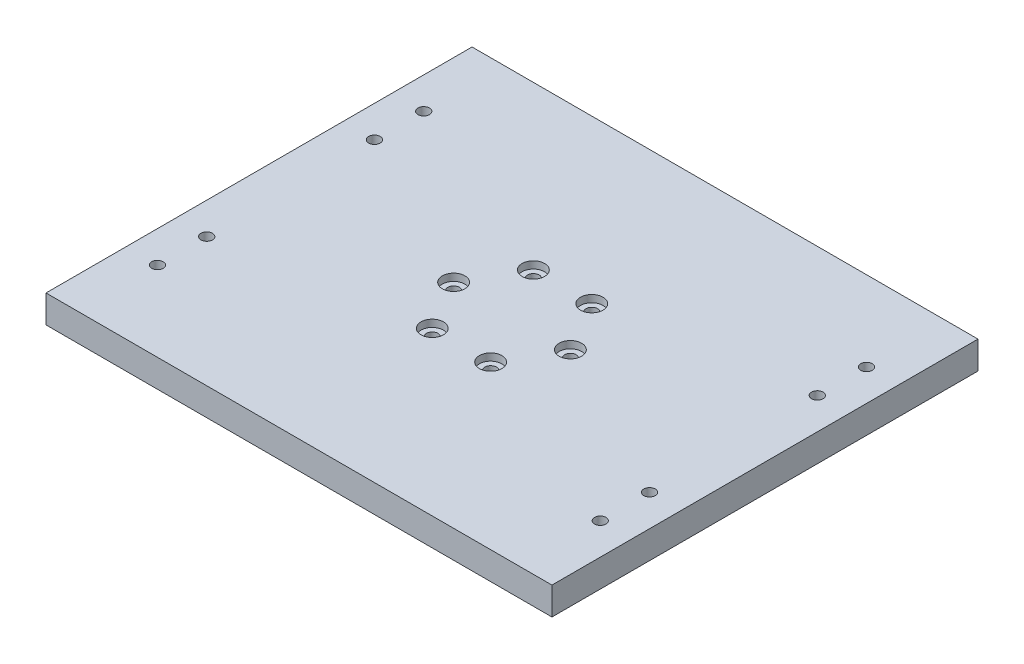
ISO-10303-21;
HEADER;
FILE_DESCRIPTION(('STEP AP214'),'2;1');
FILE_NAME('part.step','',(''),(''),'','','');
FILE_SCHEMA(('AUTOMOTIVE_DESIGN { 1 0 10303 214 1 1 1 1 }'));
ENDSEC;
DATA;
#1=APPLICATION_CONTEXT('core data for automotive mechanical design processes');
#2=APPLICATION_PROTOCOL_DEFINITION('international standard','automotive_design',2000,#1);
#3=PRODUCT_CONTEXT('',#1,'mechanical');
#4=PRODUCT('Part','Part','',(#3));
#5=PRODUCT_RELATED_PRODUCT_CATEGORY('part','',(#4));
#6=PRODUCT_DEFINITION_FORMATION('','',#4);
#7=PRODUCT_DEFINITION_CONTEXT('part definition',#1,'design');
#8=PRODUCT_DEFINITION('design','',#6,#7);
#9=PRODUCT_DEFINITION_SHAPE('','',#8);
#10=(LENGTH_UNIT() NAMED_UNIT(*) SI_UNIT(.MILLI.,.METRE.));
#11=(NAMED_UNIT(*) PLANE_ANGLE_UNIT() SI_UNIT($,.RADIAN.));
#12=(NAMED_UNIT(*) SI_UNIT($,.STERADIAN.) SOLID_ANGLE_UNIT());
#13=UNCERTAINTY_MEASURE_WITH_UNIT(LENGTH_MEASURE(1.E-05),#10,'distance_accuracy_value','');
#14=(GEOMETRIC_REPRESENTATION_CONTEXT(3) GLOBAL_UNCERTAINTY_ASSIGNED_CONTEXT((#13)) GLOBAL_UNIT_ASSIGNED_CONTEXT((#10,
#11,#12)) REPRESENTATION_CONTEXT('',''));
#15=CARTESIAN_POINT('',(0.,0.,0.));
#16=DIRECTION('',(0.,0.,1.));
#17=DIRECTION('',(1.,0.,0.));
#18=AXIS2_PLACEMENT_3D('',#15,#16,#17);
#19=CARTESIAN_POINT('',(0.,26.416,0.));
#20=DIRECTION('',(0.,-1.,0.));
#21=DIRECTION('',(0.,0.,-1.));
#22=AXIS2_PLACEMENT_3D('',#19,#20,#21);
#23=PLANE('',#22);
#24=CARTESIAN_POINT('',(-211.201,26.416,-127.));
#25=DIRECTION('',(0.,1.,0.));
#26=DIRECTION('',(0.,0.,1.));
#27=AXIS2_PLACEMENT_3D('',#24,#25,#26);
#28=CIRCLE('',#27,5.50000000000001);
#29=CARTESIAN_POINT('',(-211.201,26.416,-121.5));
#30=VERTEX_POINT('',#29);
#31=EDGE_CURVE('E297',#30,#30,#28,.T.);
#32=ORIENTED_EDGE('',*,*,#31,.F.);
#33=EDGE_LOOP('',(#32));
#34=FACE_BOUND('',#33,.T.);
#35=CARTESIAN_POINT('',(-211.201,26.416,-80.01));
#36=DIRECTION('',(0.,1.,0.));
#37=DIRECTION('',(0.,0.,1.));
#38=AXIS2_PLACEMENT_3D('',#35,#36,#37);
#39=CIRCLE('',#38,5.50000000000001);
#40=CARTESIAN_POINT('',(-211.201,26.416,-74.51));
#41=VERTEX_POINT('',#40);
#42=EDGE_CURVE('E289',#41,#41,#39,.T.);
#43=ORIENTED_EDGE('',*,*,#42,.F.);
#44=EDGE_LOOP('',(#43));
#45=FACE_BOUND('',#44,.T.);
#46=CARTESIAN_POINT('',(-211.201,26.416,80.01));
#47=DIRECTION('',(0.,1.,0.));
#48=DIRECTION('',(0.,0.,1.));
#49=AXIS2_PLACEMENT_3D('',#46,#47,#48);
#50=CIRCLE('',#49,5.50000000000001);
#51=CARTESIAN_POINT('',(-211.201,26.416,85.51));
#52=VERTEX_POINT('',#51);
#53=EDGE_CURVE('E281',#52,#52,#50,.T.);
#54=ORIENTED_EDGE('',*,*,#53,.F.);
#55=EDGE_LOOP('',(#54));
#56=FACE_BOUND('',#55,.T.);
#57=DIRECTION('',(0.,0.,-1.));
#58=VECTOR('',#57,1.);
#59=CARTESIAN_POINT('',(241.3,26.416,203.2));
#60=LINE('',#59,#58);
#61=CARTESIAN_POINT('',(241.3,26.416,203.2));
#62=VERTEX_POINT('',#61);
#63=CARTESIAN_POINT('',(241.3,26.416,-203.2));
#64=VERTEX_POINT('',#63);
#65=EDGE_CURVE('E98',#62,#64,#60,.T.);
#66=ORIENTED_EDGE('',*,*,#65,.T.);
#67=DIRECTION('',(-1.,0.,0.));
#68=VECTOR('',#67,1.);
#69=CARTESIAN_POINT('',(-241.3,26.416,-203.2));
#70=LINE('',#69,#68);
#71=CARTESIAN_POINT('',(-241.3,26.416,-203.2));
#72=VERTEX_POINT('',#71);
#73=EDGE_CURVE('E93',#64,#72,#70,.T.);
#74=ORIENTED_EDGE('',*,*,#73,.T.);
#75=DIRECTION('',(0.,0.,1.));
#76=VECTOR('',#75,1.);
#77=CARTESIAN_POINT('',(-241.3,26.416,203.2));
#78=LINE('',#77,#76);
#79=CARTESIAN_POINT('',(-241.3,26.416,203.2));
#80=VERTEX_POINT('',#79);
#81=EDGE_CURVE('E96',#72,#80,#78,.T.);
#82=ORIENTED_EDGE('',*,*,#81,.T.);
#83=DIRECTION('',(1.,0.,0.));
#84=VECTOR('',#83,1.);
#85=CARTESIAN_POINT('',(-241.3,26.416,203.2));
#86=LINE('',#85,#84);
#87=EDGE_CURVE('E63',#80,#62,#86,.T.);
#88=ORIENTED_EDGE('',*,*,#87,.T.);
#89=EDGE_LOOP('',(#66,#74,#82,#88));
#90=FACE_BOUND('',#89,.T.);
#91=CARTESIAN_POINT('',(-27.8500000000002,26.416,-48.2376149907929));
#92=DIRECTION('',(0.,1.,0.));
#93=DIRECTION('',(0.,0.,1.));
#94=AXIS2_PLACEMENT_3D('',#91,#92,#93);
#95=CIRCLE('',#94,10.74);
#96=CARTESIAN_POINT('',(-27.8500000000002,26.416,-37.4976149907929));
#97=VERTEX_POINT('',#96);
#98=EDGE_CURVE('E153',#97,#97,#95,.T.);
#99=ORIENTED_EDGE('',*,*,#98,.F.);
#100=EDGE_LOOP('',(#99));
#101=FACE_BOUND('',#100,.T.);
#102=CARTESIAN_POINT('',(-55.7,26.416,-3.88951021147125E-13));
#103=DIRECTION('',(0.,1.,0.));
#104=DIRECTION('',(0.,0.,1.));
#105=AXIS2_PLACEMENT_3D('',#102,#103,#104);
#106=CIRCLE('',#105,10.74);
#107=CARTESIAN_POINT('',(-55.7,26.416,10.7399999999996));
#108=VERTEX_POINT('',#107);
#109=EDGE_CURVE('E169',#108,#108,#106,.T.);
#110=ORIENTED_EDGE('',*,*,#109,.F.);
#111=EDGE_LOOP('',(#110));
#112=FACE_BOUND('',#111,.T.);
#113=CARTESIAN_POINT('',(-27.8500000000002,26.416,48.2376149907931));
#114=DIRECTION('',(0.,1.,0.));
#115=DIRECTION('',(0.,0.,1.));
#116=AXIS2_PLACEMENT_3D('',#113,#114,#115);
#117=CIRCLE('',#116,10.74);
#118=CARTESIAN_POINT('',(-27.8500000000002,26.416,58.9776149907931));
#119=VERTEX_POINT('',#118);
#120=EDGE_CURVE('E185',#119,#119,#117,.T.);
#121=ORIENTED_EDGE('',*,*,#120,.F.);
#122=EDGE_LOOP('',(#121));
#123=FACE_BOUND('',#122,.T.);
#124=CARTESIAN_POINT('',(27.8499999999999,26.416,48.2376149907933));
#125=DIRECTION('',(0.,1.,0.));
#126=DIRECTION('',(0.,0.,1.));
#127=AXIS2_PLACEMENT_3D('',#124,#125,#126);
#128=CIRCLE('',#127,10.74);
#129=CARTESIAN_POINT('',(27.8499999999999,26.416,58.9776149907933));
#130=VERTEX_POINT('',#129);
#131=EDGE_CURVE('E201',#130,#130,#128,.T.);
#132=ORIENTED_EDGE('',*,*,#131,.F.);
#133=EDGE_LOOP('',(#132));
#134=FACE_BOUND('',#133,.T.);
#135=CARTESIAN_POINT('',(55.7,26.416,0.));
#136=DIRECTION('',(0.,1.,0.));
#137=DIRECTION('',(0.,0.,1.));
#138=AXIS2_PLACEMENT_3D('',#135,#136,#137);
#139=CIRCLE('',#138,10.74);
#140=CARTESIAN_POINT('',(55.7,26.416,10.74));
#141=VERTEX_POINT('',#140);
#142=EDGE_CURVE('E217',#141,#141,#139,.T.);
#143=ORIENTED_EDGE('',*,*,#142,.F.);
#144=EDGE_LOOP('',(#143));
#145=FACE_BOUND('',#144,.T.);
#146=CARTESIAN_POINT('',(27.8500000000006,26.416,-48.2376149907929));
#147=DIRECTION('',(0.,1.,0.));
#148=DIRECTION('',(0.,0.,1.));
#149=AXIS2_PLACEMENT_3D('',#146,#147,#148);
#150=CIRCLE('',#149,10.74);
#151=CARTESIAN_POINT('',(27.8500000000006,26.416,-37.4976149907929));
#152=VERTEX_POINT('',#151);
#153=EDGE_CURVE('E233',#152,#152,#150,.T.);
#154=ORIENTED_EDGE('',*,*,#153,.F.);
#155=EDGE_LOOP('',(#154));
#156=FACE_BOUND('',#155,.T.);
#157=CARTESIAN_POINT('',(211.201,26.416,-127.));
#158=DIRECTION('',(0.,1.,0.));
#159=DIRECTION('',(0.,0.,1.));
#160=AXIS2_PLACEMENT_3D('',#157,#158,#159);
#161=CIRCLE('',#160,5.50000000000001);
#162=CARTESIAN_POINT('',(211.201,26.416,-121.5));
#163=VERTEX_POINT('',#162);
#164=EDGE_CURVE('E241',#163,#163,#161,.T.);
#165=ORIENTED_EDGE('',*,*,#164,.F.);
#166=EDGE_LOOP('',(#165));
#167=FACE_BOUND('',#166,.T.);
#168=CARTESIAN_POINT('',(211.201,26.416,-80.01));
#169=DIRECTION('',(0.,1.,0.));
#170=DIRECTION('',(0.,0.,1.));
#171=AXIS2_PLACEMENT_3D('',#168,#169,#170);
#172=CIRCLE('',#171,5.50000000000001);
#173=CARTESIAN_POINT('',(211.201,26.416,-74.51));
#174=VERTEX_POINT('',#173);
#175=EDGE_CURVE('E249',#174,#174,#172,.T.);
#176=ORIENTED_EDGE('',*,*,#175,.F.);
#177=EDGE_LOOP('',(#176));
#178=FACE_BOUND('',#177,.T.);
#179=CARTESIAN_POINT('',(211.201,26.416,80.0099999999999));
#180=DIRECTION('',(0.,1.,0.));
#181=DIRECTION('',(0.,0.,1.));
#182=AXIS2_PLACEMENT_3D('',#179,#180,#181);
#183=CIRCLE('',#182,5.50000000000001);
#184=CARTESIAN_POINT('',(211.201,26.416,85.5099999999999));
#185=VERTEX_POINT('',#184);
#186=EDGE_CURVE('E257',#185,#185,#183,.T.);
#187=ORIENTED_EDGE('',*,*,#186,.F.);
#188=EDGE_LOOP('',(#187));
#189=FACE_BOUND('',#188,.T.);
#190=CARTESIAN_POINT('',(211.201,26.416,127.));
#191=DIRECTION('',(0.,1.,0.));
#192=DIRECTION('',(0.,0.,1.));
#193=AXIS2_PLACEMENT_3D('',#190,#191,#192);
#194=CIRCLE('',#193,5.50000000000001);
#195=CARTESIAN_POINT('',(211.201,26.416,132.5));
#196=VERTEX_POINT('',#195);
#197=EDGE_CURVE('E265',#196,#196,#194,.T.);
#198=ORIENTED_EDGE('',*,*,#197,.F.);
#199=EDGE_LOOP('',(#198));
#200=FACE_BOUND('',#199,.T.);
#201=CARTESIAN_POINT('',(-211.201,26.416,127.));
#202=DIRECTION('',(0.,1.,0.));
#203=DIRECTION('',(0.,0.,1.));
#204=AXIS2_PLACEMENT_3D('',#201,#202,#203);
#205=CIRCLE('',#204,5.50000000000001);
#206=CARTESIAN_POINT('',(-211.201,26.416,132.5));
#207=VERTEX_POINT('',#206);
#208=EDGE_CURVE('E273',#207,#207,#205,.T.);
#209=ORIENTED_EDGE('',*,*,#208,.F.);
#210=EDGE_LOOP('',(#209));
#211=FACE_BOUND('',#210,.T.);
#212=ADVANCED_FACE('F45',(#34,#45,#56,#90,#101,#112,#123,#134,#145,#156,#167,#178,#189,#200,
#211),#23,.F.);
#213=CARTESIAN_POINT('',(0.,0.,0.));
#214=DIRECTION('',(0.,-1.,0.));
#215=DIRECTION('',(0.,0.,-1.));
#216=AXIS2_PLACEMENT_3D('',#213,#214,#215);
#217=PLANE('',#216);
#218=CARTESIAN_POINT('',(-211.201,0.,-127.));
#219=DIRECTION('',(0.,1.,0.));
#220=DIRECTION('',(0.,0.,1.));
#221=AXIS2_PLACEMENT_3D('',#218,#219,#220);
#222=CIRCLE('',#221,5.50000000000001);
#223=CARTESIAN_POINT('',(-211.201,0.,-121.5));
#224=VERTEX_POINT('',#223);
#225=EDGE_CURVE('E293',#224,#224,#222,.T.);
#226=ORIENTED_EDGE('',*,*,#225,.T.);
#227=EDGE_LOOP('',(#226));
#228=FACE_BOUND('',#227,.T.);
#229=CARTESIAN_POINT('',(-211.201,0.,-80.01));
#230=DIRECTION('',(0.,1.,0.));
#231=DIRECTION('',(0.,0.,1.));
#232=AXIS2_PLACEMENT_3D('',#229,#230,#231);
#233=CIRCLE('',#232,5.50000000000001);
#234=CARTESIAN_POINT('',(-211.201,0.,-74.51));
#235=VERTEX_POINT('',#234);
#236=EDGE_CURVE('E285',#235,#235,#233,.T.);
#237=ORIENTED_EDGE('',*,*,#236,.T.);
#238=EDGE_LOOP('',(#237));
#239=FACE_BOUND('',#238,.T.);
#240=CARTESIAN_POINT('',(-211.201,0.,80.01));
#241=DIRECTION('',(0.,1.,0.));
#242=DIRECTION('',(0.,0.,1.));
#243=AXIS2_PLACEMENT_3D('',#240,#241,#242);
#244=CIRCLE('',#243,5.50000000000001);
#245=CARTESIAN_POINT('',(-211.201,0.,85.51));
#246=VERTEX_POINT('',#245);
#247=EDGE_CURVE('E277',#246,#246,#244,.T.);
#248=ORIENTED_EDGE('',*,*,#247,.T.);
#249=EDGE_LOOP('',(#248));
#250=FACE_BOUND('',#249,.T.);
#251=CARTESIAN_POINT('',(-211.201,0.,127.));
#252=DIRECTION('',(0.,1.,0.));
#253=DIRECTION('',(0.,0.,1.));
#254=AXIS2_PLACEMENT_3D('',#251,#252,#253);
#255=CIRCLE('',#254,5.50000000000001);
#256=CARTESIAN_POINT('',(-211.201,0.,132.5));
#257=VERTEX_POINT('',#256);
#258=EDGE_CURVE('E269',#257,#257,#255,.T.);
#259=ORIENTED_EDGE('',*,*,#258,.T.);
#260=EDGE_LOOP('',(#259));
#261=FACE_BOUND('',#260,.T.);
#262=CARTESIAN_POINT('',(211.201,0.,127.));
#263=DIRECTION('',(0.,1.,0.));
#264=DIRECTION('',(0.,0.,1.));
#265=AXIS2_PLACEMENT_3D('',#262,#263,#264);
#266=CIRCLE('',#265,5.50000000000001);
#267=CARTESIAN_POINT('',(211.201,0.,132.5));
#268=VERTEX_POINT('',#267);
#269=EDGE_CURVE('E261',#268,#268,#266,.T.);
#270=ORIENTED_EDGE('',*,*,#269,.T.);
#271=EDGE_LOOP('',(#270));
#272=FACE_BOUND('',#271,.T.);
#273=DIRECTION('',(0.,0.,-1.));
#274=VECTOR('',#273,1.);
#275=CARTESIAN_POINT('',(241.3,0.,203.2));
#276=LINE('',#275,#274);
#277=CARTESIAN_POINT('',(241.3,0.,203.2));
#278=VERTEX_POINT('',#277);
#279=CARTESIAN_POINT('',(241.3,0.,-203.2));
#280=VERTEX_POINT('',#279);
#281=EDGE_CURVE('E116',#278,#280,#276,.T.);
#282=ORIENTED_EDGE('',*,*,#281,.F.);
#283=DIRECTION('',(1.,0.,0.));
#284=VECTOR('',#283,1.);
#285=CARTESIAN_POINT('',(-241.3,0.,203.2));
#286=LINE('',#285,#284);
#287=CARTESIAN_POINT('',(-241.3,0.,203.2));
#288=VERTEX_POINT('',#287);
#289=EDGE_CURVE('E86',#288,#278,#286,.T.);
#290=ORIENTED_EDGE('',*,*,#289,.F.);
#291=DIRECTION('',(0.,0.,1.));
#292=VECTOR('',#291,1.);
#293=CARTESIAN_POINT('',(-241.3,0.,203.2));
#294=LINE('',#293,#292);
#295=CARTESIAN_POINT('',(-241.3,0.,-203.2));
#296=VERTEX_POINT('',#295);
#297=EDGE_CURVE('E80',#296,#288,#294,.T.);
#298=ORIENTED_EDGE('',*,*,#297,.F.);
#299=DIRECTION('',(-1.,0.,0.));
#300=VECTOR('',#299,1.);
#301=CARTESIAN_POINT('',(-241.3,0.,-203.2));
#302=LINE('',#301,#300);
#303=EDGE_CURVE('E103',#280,#296,#302,.T.);
#304=ORIENTED_EDGE('',*,*,#303,.F.);
#305=EDGE_LOOP('',(#282,#290,#298,#304));
#306=FACE_BOUND('',#305,.T.);
#307=CARTESIAN_POINT('',(-27.8500000000002,0.,-48.2376149907929));
#308=DIRECTION('',(0.,1.,0.));
#309=DIRECTION('',(0.,0.,1.));
#310=AXIS2_PLACEMENT_3D('',#307,#308,#309);
#311=CIRCLE('',#310,5.49999999999999);
#312=CARTESIAN_POINT('',(-27.8500000000002,0.,-42.7376149907929));
#313=VERTEX_POINT('',#312);
#314=EDGE_CURVE('E120',#313,#313,#311,.T.);
#315=ORIENTED_EDGE('',*,*,#314,.T.);
#316=EDGE_LOOP('',(#315));
#317=FACE_BOUND('',#316,.T.);
#318=CARTESIAN_POINT('',(-55.7,0.,-3.88951021147125E-13));
#319=DIRECTION('',(0.,1.,0.));
#320=DIRECTION('',(0.,0.,1.));
#321=AXIS2_PLACEMENT_3D('',#318,#319,#320);
#322=CIRCLE('',#321,5.49999999999999);
#323=CARTESIAN_POINT('',(-55.7,0.,5.4999999999996));
#324=VERTEX_POINT('',#323);
#325=EDGE_CURVE('E157',#324,#324,#322,.T.);
#326=ORIENTED_EDGE('',*,*,#325,.T.);
#327=EDGE_LOOP('',(#326));
#328=FACE_BOUND('',#327,.T.);
#329=CARTESIAN_POINT('',(-27.8500000000002,0.,48.2376149907931));
#330=DIRECTION('',(0.,1.,0.));
#331=DIRECTION('',(0.,0.,1.));
#332=AXIS2_PLACEMENT_3D('',#329,#330,#331);
#333=CIRCLE('',#332,5.49999999999999);
#334=CARTESIAN_POINT('',(-27.8500000000002,0.,53.7376149907931));
#335=VERTEX_POINT('',#334);
#336=EDGE_CURVE('E173',#335,#335,#333,.T.);
#337=ORIENTED_EDGE('',*,*,#336,.T.);
#338=EDGE_LOOP('',(#337));
#339=FACE_BOUND('',#338,.T.);
#340=CARTESIAN_POINT('',(27.8499999999999,0.,48.2376149907933));
#341=DIRECTION('',(0.,1.,0.));
#342=DIRECTION('',(0.,0.,1.));
#343=AXIS2_PLACEMENT_3D('',#340,#341,#342);
#344=CIRCLE('',#343,5.49999999999999);
#345=CARTESIAN_POINT('',(27.8499999999999,0.,53.7376149907933));
#346=VERTEX_POINT('',#345);
#347=EDGE_CURVE('E189',#346,#346,#344,.T.);
#348=ORIENTED_EDGE('',*,*,#347,.T.);
#349=EDGE_LOOP('',(#348));
#350=FACE_BOUND('',#349,.T.);
#351=CARTESIAN_POINT('',(55.7,0.,0.));
#352=DIRECTION('',(0.,1.,0.));
#353=DIRECTION('',(0.,0.,1.));
#354=AXIS2_PLACEMENT_3D('',#351,#352,#353);
#355=CIRCLE('',#354,5.49999999999999);
#356=CARTESIAN_POINT('',(55.7,0.,5.49999999999999));
#357=VERTEX_POINT('',#356);
#358=EDGE_CURVE('E205',#357,#357,#355,.T.);
#359=ORIENTED_EDGE('',*,*,#358,.T.);
#360=EDGE_LOOP('',(#359));
#361=FACE_BOUND('',#360,.T.);
#362=CARTESIAN_POINT('',(27.8500000000006,0.,-48.2376149907929));
#363=DIRECTION('',(0.,1.,0.));
#364=DIRECTION('',(0.,0.,1.));
#365=AXIS2_PLACEMENT_3D('',#362,#363,#364);
#366=CIRCLE('',#365,5.49999999999999);
#367=CARTESIAN_POINT('',(27.8500000000006,0.,-42.7376149907929));
#368=VERTEX_POINT('',#367);
#369=EDGE_CURVE('E221',#368,#368,#366,.T.);
#370=ORIENTED_EDGE('',*,*,#369,.T.);
#371=EDGE_LOOP('',(#370));
#372=FACE_BOUND('',#371,.T.);
#373=CARTESIAN_POINT('',(211.201,0.,-127.));
#374=DIRECTION('',(0.,1.,0.));
#375=DIRECTION('',(0.,0.,1.));
#376=AXIS2_PLACEMENT_3D('',#373,#374,#375);
#377=CIRCLE('',#376,5.50000000000001);
#378=CARTESIAN_POINT('',(211.201,0.,-121.5));
#379=VERTEX_POINT('',#378);
#380=EDGE_CURVE('E237',#379,#379,#377,.T.);
#381=ORIENTED_EDGE('',*,*,#380,.T.);
#382=EDGE_LOOP('',(#381));
#383=FACE_BOUND('',#382,.T.);
#384=CARTESIAN_POINT('',(211.201,0.,-80.01));
#385=DIRECTION('',(0.,1.,0.));
#386=DIRECTION('',(0.,0.,1.));
#387=AXIS2_PLACEMENT_3D('',#384,#385,#386);
#388=CIRCLE('',#387,5.50000000000001);
#389=CARTESIAN_POINT('',(211.201,0.,-74.51));
#390=VERTEX_POINT('',#389);
#391=EDGE_CURVE('E245',#390,#390,#388,.T.);
#392=ORIENTED_EDGE('',*,*,#391,.T.);
#393=EDGE_LOOP('',(#392));
#394=FACE_BOUND('',#393,.T.);
#395=CARTESIAN_POINT('',(211.201,0.,80.0099999999999));
#396=DIRECTION('',(0.,1.,0.));
#397=DIRECTION('',(0.,0.,1.));
#398=AXIS2_PLACEMENT_3D('',#395,#396,#397);
#399=CIRCLE('',#398,5.50000000000001);
#400=CARTESIAN_POINT('',(211.201,0.,85.5099999999999));
#401=VERTEX_POINT('',#400);
#402=EDGE_CURVE('E253',#401,#401,#399,.T.);
#403=ORIENTED_EDGE('',*,*,#402,.T.);
#404=EDGE_LOOP('',(#403));
#405=FACE_BOUND('',#404,.T.);
#406=ADVANCED_FACE('F135',(#228,#239,#250,#261,#272,#306,#317,#328,#339,#350,#361,#372,#383,
#394,#405),#217,.T.);
#407=CARTESIAN_POINT('',(241.3,26.416,203.2));
#408=DIRECTION('',(-1.,0.,0.));
#409=DIRECTION('',(0.,0.,1.));
#410=AXIS2_PLACEMENT_3D('',#407,#408,#409);
#411=PLANE('',#410);
#412=ORIENTED_EDGE('',*,*,#281,.T.);
#413=DIRECTION('',(0.,-1.,0.));
#414=VECTOR('',#413,1.);
#415=CARTESIAN_POINT('',(241.3,26.416,-203.2));
#416=LINE('',#415,#414);
#417=EDGE_CURVE('E11',#64,#280,#416,.T.);
#418=ORIENTED_EDGE('',*,*,#417,.F.);
#419=ORIENTED_EDGE('',*,*,#65,.F.);
#420=DIRECTION('',(0.,-1.,0.));
#421=VECTOR('',#420,1.);
#422=CARTESIAN_POINT('',(241.3,26.416,203.2));
#423=LINE('',#422,#421);
#424=EDGE_CURVE('E112',#62,#278,#423,.T.);
#425=ORIENTED_EDGE('',*,*,#424,.T.);
#426=EDGE_LOOP('',(#412,#418,#419,#425));
#427=FACE_BOUND('',#426,.T.);
#428=ADVANCED_FACE('F47',(#427),#411,.F.);
#429=CARTESIAN_POINT('',(-241.3,26.416,-203.2));
#430=DIRECTION('',(0.,0.,1.));
#431=DIRECTION('',(1.,0.,0.));
#432=AXIS2_PLACEMENT_3D('',#429,#430,#431);
#433=PLANE('',#432);
#434=ORIENTED_EDGE('',*,*,#303,.T.);
#435=DIRECTION('',(0.,-1.,0.));
#436=VECTOR('',#435,1.);
#437=CARTESIAN_POINT('',(-241.3,26.416,-203.2));
#438=LINE('',#437,#436);
#439=EDGE_CURVE('E55',#72,#296,#438,.T.);
#440=ORIENTED_EDGE('',*,*,#439,.F.);
#441=ORIENTED_EDGE('',*,*,#73,.F.);
#442=ORIENTED_EDGE('',*,*,#417,.T.);
#443=EDGE_LOOP('',(#434,#440,#441,#442));
#444=FACE_BOUND('',#443,.T.);
#445=ADVANCED_FACE('F102',(#444),#433,.F.);
#446=CARTESIAN_POINT('',(-241.3,26.416,203.2));
#447=DIRECTION('',(1.,0.,0.));
#448=DIRECTION('',(0.,0.,-1.));
#449=AXIS2_PLACEMENT_3D('',#446,#447,#448);
#450=PLANE('',#449);
#451=ORIENTED_EDGE('',*,*,#297,.T.);
#452=DIRECTION('',(0.,-1.,0.));
#453=VECTOR('',#452,1.);
#454=CARTESIAN_POINT('',(-241.3,26.416,203.2));
#455=LINE('',#454,#453);
#456=EDGE_CURVE('E105',#80,#288,#455,.T.);
#457=ORIENTED_EDGE('',*,*,#456,.F.);
#458=ORIENTED_EDGE('',*,*,#81,.F.);
#459=ORIENTED_EDGE('',*,*,#439,.T.);
#460=EDGE_LOOP('',(#451,#457,#458,#459));
#461=FACE_BOUND('',#460,.T.);
#462=ADVANCED_FACE('F106',(#461),#450,.F.);
#463=CARTESIAN_POINT('',(-241.3,26.416,203.2));
#464=DIRECTION('',(0.,0.,-1.));
#465=DIRECTION('',(-1.,0.,0.));
#466=AXIS2_PLACEMENT_3D('',#463,#464,#465);
#467=PLANE('',#466);
#468=ORIENTED_EDGE('',*,*,#289,.T.);
#469=ORIENTED_EDGE('',*,*,#424,.F.);
#470=ORIENTED_EDGE('',*,*,#87,.F.);
#471=ORIENTED_EDGE('',*,*,#456,.T.);
#472=EDGE_LOOP('',(#468,#469,#470,#471));
#473=FACE_BOUND('',#472,.T.);
#474=ADVANCED_FACE('F132',(#473),#467,.F.);
#475=CARTESIAN_POINT('',(-27.8500000000002,26.416,-48.2376149907929));
#476=DIRECTION('',(0.,1.,0.));
#477=DIRECTION('',(0.,0.,1.));
#478=AXIS2_PLACEMENT_3D('',#475,#476,#477);
#479=CYLINDRICAL_SURFACE('',#478,5.5);
#480=ORIENTED_EDGE('',*,*,#314,.F.);
#481=EDGE_LOOP('',(#480));
#482=FACE_BOUND('',#481,.T.);
#483=CARTESIAN_POINT('',(-27.8500000000002,19.566,-48.2376149907929));
#484=DIRECTION('',(0.,1.,0.));
#485=DIRECTION('',(0.,0.,1.));
#486=AXIS2_PLACEMENT_3D('',#483,#484,#485);
#487=CIRCLE('',#486,5.5);
#488=CARTESIAN_POINT('',(-27.8500000000002,19.566,-42.7376149907929));
#489=VERTEX_POINT('',#488);
#490=EDGE_CURVE('E145',#489,#489,#487,.T.);
#491=ORIENTED_EDGE('',*,*,#490,.T.);
#492=EDGE_LOOP('',(#491));
#493=FACE_BOUND('',#492,.T.);
#494=ADVANCED_FACE('F413',(#482,#493),#479,.F.);
#495=CARTESIAN_POINT('',(-22.3500000000002,19.566,-48.2376149907929));
#496=DIRECTION('',(0.,-1.,0.));
#497=DIRECTION('',(0.,0.,-1.));
#498=AXIS2_PLACEMENT_3D('',#495,#496,#497);
#499=PLANE('',#498);
#500=ORIENTED_EDGE('',*,*,#490,.F.);
#501=EDGE_LOOP('',(#500));
#502=FACE_BOUND('',#501,.T.);
#503=CARTESIAN_POINT('',(-27.8500000000002,19.566,-48.2376149907929));
#504=DIRECTION('',(0.,1.,0.));
#505=DIRECTION('',(0.,0.,1.));
#506=AXIS2_PLACEMENT_3D('',#503,#504,#505);
#507=CIRCLE('',#506,10.74);
#508=CARTESIAN_POINT('',(-27.8500000000002,19.566,-37.4976149907929));
#509=VERTEX_POINT('',#508);
#510=EDGE_CURVE('E149',#509,#509,#507,.T.);
#511=ORIENTED_EDGE('',*,*,#510,.T.);
#512=EDGE_LOOP('',(#511));
#513=FACE_BOUND('',#512,.T.);
#514=ADVANCED_FACE('F409',(#502,#513),#499,.F.);
#515=CARTESIAN_POINT('',(-27.8500000000002,26.416,-48.2376149907929));
#516=DIRECTION('',(0.,1.,0.));
#517=DIRECTION('',(0.,0.,1.));
#518=AXIS2_PLACEMENT_3D('',#515,#516,#517);
#519=CYLINDRICAL_SURFACE('',#518,10.74);
#520=ORIENTED_EDGE('',*,*,#510,.F.);
#521=EDGE_LOOP('',(#520));
#522=FACE_BOUND('',#521,.T.);
#523=ORIENTED_EDGE('',*,*,#98,.T.);
#524=EDGE_LOOP('',(#523));
#525=FACE_BOUND('',#524,.T.);
#526=ADVANCED_FACE('F405',(#522,#525),#519,.F.);
#527=CARTESIAN_POINT('',(-55.7,26.416,-3.88951021147125E-13));
#528=DIRECTION('',(0.,1.,0.));
#529=DIRECTION('',(0.,0.,1.));
#530=AXIS2_PLACEMENT_3D('',#527,#528,#529);
#531=CYLINDRICAL_SURFACE('',#530,5.49999999999999);
#532=ORIENTED_EDGE('',*,*,#325,.F.);
#533=EDGE_LOOP('',(#532));
#534=FACE_BOUND('',#533,.T.);
#535=CARTESIAN_POINT('',(-55.7,19.566,-3.88951021147125E-13));
#536=DIRECTION('',(0.,1.,0.));
#537=DIRECTION('',(0.,0.,1.));
#538=AXIS2_PLACEMENT_3D('',#535,#536,#537);
#539=CIRCLE('',#538,5.5);
#540=CARTESIAN_POINT('',(-55.7,19.566,5.49999999999961));
#541=VERTEX_POINT('',#540);
#542=EDGE_CURVE('E161',#541,#541,#539,.T.);
#543=ORIENTED_EDGE('',*,*,#542,.T.);
#544=EDGE_LOOP('',(#543));
#545=FACE_BOUND('',#544,.T.);
#546=ADVANCED_FACE('F401',(#534,#545),#531,.F.);
#547=CARTESIAN_POINT('',(-50.2,19.566,-3.88951021147125E-13));
#548=DIRECTION('',(0.,-1.,0.));
#549=DIRECTION('',(0.,0.,-1.));
#550=AXIS2_PLACEMENT_3D('',#547,#548,#549);
#551=PLANE('',#550);
#552=ORIENTED_EDGE('',*,*,#542,.F.);
#553=EDGE_LOOP('',(#552));
#554=FACE_BOUND('',#553,.T.);
#555=CARTESIAN_POINT('',(-55.7,19.566,-3.88951021147125E-13));
#556=DIRECTION('',(0.,1.,0.));
#557=DIRECTION('',(0.,0.,1.));
#558=AXIS2_PLACEMENT_3D('',#555,#556,#557);
#559=CIRCLE('',#558,10.74);
#560=CARTESIAN_POINT('',(-55.7,19.566,10.7399999999996));
#561=VERTEX_POINT('',#560);
#562=EDGE_CURVE('E165',#561,#561,#559,.T.);
#563=ORIENTED_EDGE('',*,*,#562,.T.);
#564=EDGE_LOOP('',(#563));
#565=FACE_BOUND('',#564,.T.);
#566=ADVANCED_FACE('F397',(#554,#565),#551,.F.);
#567=CARTESIAN_POINT('',(-55.7,26.416,-3.88951021147125E-13));
#568=DIRECTION('',(0.,1.,0.));
#569=DIRECTION('',(0.,0.,1.));
#570=AXIS2_PLACEMENT_3D('',#567,#568,#569);
#571=CYLINDRICAL_SURFACE('',#570,10.74);
#572=ORIENTED_EDGE('',*,*,#562,.F.);
#573=EDGE_LOOP('',(#572));
#574=FACE_BOUND('',#573,.T.);
#575=ORIENTED_EDGE('',*,*,#109,.T.);
#576=EDGE_LOOP('',(#575));
#577=FACE_BOUND('',#576,.T.);
#578=ADVANCED_FACE('F393',(#574,#577),#571,.F.);
#579=CARTESIAN_POINT('',(-27.8500000000002,26.416,48.2376149907931));
#580=DIRECTION('',(0.,1.,0.));
#581=DIRECTION('',(0.,0.,1.));
#582=AXIS2_PLACEMENT_3D('',#579,#580,#581);
#583=CYLINDRICAL_SURFACE('',#582,5.5);
#584=ORIENTED_EDGE('',*,*,#336,.F.);
#585=EDGE_LOOP('',(#584));
#586=FACE_BOUND('',#585,.T.);
#587=CARTESIAN_POINT('',(-27.8500000000002,19.566,48.2376149907931));
#588=DIRECTION('',(0.,1.,0.));
#589=DIRECTION('',(0.,0.,1.));
#590=AXIS2_PLACEMENT_3D('',#587,#588,#589);
#591=CIRCLE('',#590,5.5);
#592=CARTESIAN_POINT('',(-27.8500000000002,19.566,53.7376149907931));
#593=VERTEX_POINT('',#592);
#594=EDGE_CURVE('E177',#593,#593,#591,.T.);
#595=ORIENTED_EDGE('',*,*,#594,.T.);
#596=EDGE_LOOP('',(#595));
#597=FACE_BOUND('',#596,.T.);
#598=ADVANCED_FACE('F389',(#586,#597),#583,.F.);
#599=CARTESIAN_POINT('',(-22.3500000000002,19.566,48.2376149907931));
#600=DIRECTION('',(0.,-1.,0.));
#601=DIRECTION('',(0.,0.,-1.));
#602=AXIS2_PLACEMENT_3D('',#599,#600,#601);
#603=PLANE('',#602);
#604=ORIENTED_EDGE('',*,*,#594,.F.);
#605=EDGE_LOOP('',(#604));
#606=FACE_BOUND('',#605,.T.);
#607=CARTESIAN_POINT('',(-27.8500000000002,19.566,48.2376149907931));
#608=DIRECTION('',(0.,1.,0.));
#609=DIRECTION('',(0.,0.,1.));
#610=AXIS2_PLACEMENT_3D('',#607,#608,#609);
#611=CIRCLE('',#610,10.74);
#612=CARTESIAN_POINT('',(-27.8500000000002,19.566,58.9776149907931));
#613=VERTEX_POINT('',#612);
#614=EDGE_CURVE('E181',#613,#613,#611,.T.);
#615=ORIENTED_EDGE('',*,*,#614,.T.);
#616=EDGE_LOOP('',(#615));
#617=FACE_BOUND('',#616,.T.);
#618=ADVANCED_FACE('F385',(#606,#617),#603,.F.);
#619=CARTESIAN_POINT('',(-27.8500000000002,26.416,48.2376149907931));
#620=DIRECTION('',(0.,1.,0.));
#621=DIRECTION('',(0.,0.,1.));
#622=AXIS2_PLACEMENT_3D('',#619,#620,#621);
#623=CYLINDRICAL_SURFACE('',#622,10.74);
#624=ORIENTED_EDGE('',*,*,#614,.F.);
#625=EDGE_LOOP('',(#624));
#626=FACE_BOUND('',#625,.T.);
#627=ORIENTED_EDGE('',*,*,#120,.T.);
#628=EDGE_LOOP('',(#627));
#629=FACE_BOUND('',#628,.T.);
#630=ADVANCED_FACE('F381',(#626,#629),#623,.F.);
#631=CARTESIAN_POINT('',(27.8499999999999,26.416,48.2376149907933));
#632=DIRECTION('',(0.,1.,0.));
#633=DIRECTION('',(0.,0.,1.));
#634=AXIS2_PLACEMENT_3D('',#631,#632,#633);
#635=CYLINDRICAL_SURFACE('',#634,5.49999999999999);
#636=ORIENTED_EDGE('',*,*,#347,.F.);
#637=EDGE_LOOP('',(#636));
#638=FACE_BOUND('',#637,.T.);
#639=CARTESIAN_POINT('',(27.8499999999999,19.566,48.2376149907933));
#640=DIRECTION('',(0.,1.,0.));
#641=DIRECTION('',(0.,0.,1.));
#642=AXIS2_PLACEMENT_3D('',#639,#640,#641);
#643=CIRCLE('',#642,5.5);
#644=CARTESIAN_POINT('',(27.8499999999999,19.566,53.7376149907933));
#645=VERTEX_POINT('',#644);
#646=EDGE_CURVE('E193',#645,#645,#643,.T.);
#647=ORIENTED_EDGE('',*,*,#646,.T.);
#648=EDGE_LOOP('',(#647));
#649=FACE_BOUND('',#648,.T.);
#650=ADVANCED_FACE('F377',(#638,#649),#635,.F.);
#651=CARTESIAN_POINT('',(33.3499999999999,19.566,48.2376149907933));
#652=DIRECTION('',(0.,-1.,0.));
#653=DIRECTION('',(0.,0.,-1.));
#654=AXIS2_PLACEMENT_3D('',#651,#652,#653);
#655=PLANE('',#654);
#656=ORIENTED_EDGE('',*,*,#646,.F.);
#657=EDGE_LOOP('',(#656));
#658=FACE_BOUND('',#657,.T.);
#659=CARTESIAN_POINT('',(27.8499999999999,19.566,48.2376149907933));
#660=DIRECTION('',(0.,1.,0.));
#661=DIRECTION('',(0.,0.,1.));
#662=AXIS2_PLACEMENT_3D('',#659,#660,#661);
#663=CIRCLE('',#662,10.74);
#664=CARTESIAN_POINT('',(27.8499999999999,19.566,58.9776149907933));
#665=VERTEX_POINT('',#664);
#666=EDGE_CURVE('E197',#665,#665,#663,.T.);
#667=ORIENTED_EDGE('',*,*,#666,.T.);
#668=EDGE_LOOP('',(#667));
#669=FACE_BOUND('',#668,.T.);
#670=ADVANCED_FACE('F373',(#658,#669),#655,.F.);
#671=CARTESIAN_POINT('',(27.8499999999999,26.416,48.2376149907933));
#672=DIRECTION('',(0.,1.,0.));
#673=DIRECTION('',(0.,0.,1.));
#674=AXIS2_PLACEMENT_3D('',#671,#672,#673);
#675=CYLINDRICAL_SURFACE('',#674,10.74);
#676=ORIENTED_EDGE('',*,*,#666,.F.);
#677=EDGE_LOOP('',(#676));
#678=FACE_BOUND('',#677,.T.);
#679=ORIENTED_EDGE('',*,*,#131,.T.);
#680=EDGE_LOOP('',(#679));
#681=FACE_BOUND('',#680,.T.);
#682=ADVANCED_FACE('F369',(#678,#681),#675,.F.);
#683=CARTESIAN_POINT('',(55.7,26.416,0.));
#684=DIRECTION('',(0.,1.,0.));
#685=DIRECTION('',(0.,0.,1.));
#686=AXIS2_PLACEMENT_3D('',#683,#684,#685);
#687=CYLINDRICAL_SURFACE('',#686,5.49999999999999);
#688=ORIENTED_EDGE('',*,*,#358,.F.);
#689=EDGE_LOOP('',(#688));
#690=FACE_BOUND('',#689,.T.);
#691=CARTESIAN_POINT('',(55.7,19.566,0.));
#692=DIRECTION('',(0.,1.,0.));
#693=DIRECTION('',(0.,0.,1.));
#694=AXIS2_PLACEMENT_3D('',#691,#692,#693);
#695=CIRCLE('',#694,5.5);
#696=CARTESIAN_POINT('',(55.7,19.566,5.5));
#697=VERTEX_POINT('',#696);
#698=EDGE_CURVE('E209',#697,#697,#695,.T.);
#699=ORIENTED_EDGE('',*,*,#698,.T.);
#700=EDGE_LOOP('',(#699));
#701=FACE_BOUND('',#700,.T.);
#702=ADVANCED_FACE('F365',(#690,#701),#687,.F.);
#703=CARTESIAN_POINT('',(61.2,19.566,0.));
#704=DIRECTION('',(0.,-1.,0.));
#705=DIRECTION('',(0.,0.,-1.));
#706=AXIS2_PLACEMENT_3D('',#703,#704,#705);
#707=PLANE('',#706);
#708=ORIENTED_EDGE('',*,*,#698,.F.);
#709=EDGE_LOOP('',(#708));
#710=FACE_BOUND('',#709,.T.);
#711=CARTESIAN_POINT('',(55.7,19.566,0.));
#712=DIRECTION('',(0.,1.,0.));
#713=DIRECTION('',(0.,0.,1.));
#714=AXIS2_PLACEMENT_3D('',#711,#712,#713);
#715=CIRCLE('',#714,10.74);
#716=CARTESIAN_POINT('',(55.7,19.566,10.74));
#717=VERTEX_POINT('',#716);
#718=EDGE_CURVE('E213',#717,#717,#715,.T.);
#719=ORIENTED_EDGE('',*,*,#718,.T.);
#720=EDGE_LOOP('',(#719));
#721=FACE_BOUND('',#720,.T.);
#722=ADVANCED_FACE('F361',(#710,#721),#707,.F.);
#723=CARTESIAN_POINT('',(55.7,26.416,0.));
#724=DIRECTION('',(0.,1.,0.));
#725=DIRECTION('',(0.,0.,1.));
#726=AXIS2_PLACEMENT_3D('',#723,#724,#725);
#727=CYLINDRICAL_SURFACE('',#726,10.74);
#728=ORIENTED_EDGE('',*,*,#718,.F.);
#729=EDGE_LOOP('',(#728));
#730=FACE_BOUND('',#729,.T.);
#731=ORIENTED_EDGE('',*,*,#142,.T.);
#732=EDGE_LOOP('',(#731));
#733=FACE_BOUND('',#732,.T.);
#734=ADVANCED_FACE('F357',(#730,#733),#727,.F.);
#735=CARTESIAN_POINT('',(27.8500000000006,26.416,-48.2376149907929));
#736=DIRECTION('',(0.,1.,0.));
#737=DIRECTION('',(0.,0.,1.));
#738=AXIS2_PLACEMENT_3D('',#735,#736,#737);
#739=CYLINDRICAL_SURFACE('',#738,5.49999999999999);
#740=ORIENTED_EDGE('',*,*,#369,.F.);
#741=EDGE_LOOP('',(#740));
#742=FACE_BOUND('',#741,.T.);
#743=CARTESIAN_POINT('',(27.8500000000006,19.566,-48.2376149907929));
#744=DIRECTION('',(0.,1.,0.));
#745=DIRECTION('',(0.,0.,1.));
#746=AXIS2_PLACEMENT_3D('',#743,#744,#745);
#747=CIRCLE('',#746,5.5);
#748=CARTESIAN_POINT('',(27.8500000000006,19.566,-42.7376149907929));
#749=VERTEX_POINT('',#748);
#750=EDGE_CURVE('E225',#749,#749,#747,.T.);
#751=ORIENTED_EDGE('',*,*,#750,.T.);
#752=EDGE_LOOP('',(#751));
#753=FACE_BOUND('',#752,.T.);
#754=ADVANCED_FACE('F353',(#742,#753),#739,.F.);
#755=CARTESIAN_POINT('',(33.3500000000006,19.566,-48.2376149907929));
#756=DIRECTION('',(0.,-1.,0.));
#757=DIRECTION('',(0.,0.,-1.));
#758=AXIS2_PLACEMENT_3D('',#755,#756,#757);
#759=PLANE('',#758);
#760=ORIENTED_EDGE('',*,*,#750,.F.);
#761=EDGE_LOOP('',(#760));
#762=FACE_BOUND('',#761,.T.);
#763=CARTESIAN_POINT('',(27.8500000000006,19.566,-48.2376149907929));
#764=DIRECTION('',(0.,1.,0.));
#765=DIRECTION('',(0.,0.,1.));
#766=AXIS2_PLACEMENT_3D('',#763,#764,#765);
#767=CIRCLE('',#766,10.74);
#768=CARTESIAN_POINT('',(27.8500000000006,19.566,-37.4976149907929));
#769=VERTEX_POINT('',#768);
#770=EDGE_CURVE('E229',#769,#769,#767,.T.);
#771=ORIENTED_EDGE('',*,*,#770,.T.);
#772=EDGE_LOOP('',(#771));
#773=FACE_BOUND('',#772,.T.);
#774=ADVANCED_FACE('F349',(#762,#773),#759,.F.);
#775=CARTESIAN_POINT('',(27.8500000000006,26.416,-48.2376149907929));
#776=DIRECTION('',(0.,1.,0.));
#777=DIRECTION('',(0.,0.,1.));
#778=AXIS2_PLACEMENT_3D('',#775,#776,#777);
#779=CYLINDRICAL_SURFACE('',#778,10.74);
#780=ORIENTED_EDGE('',*,*,#770,.F.);
#781=EDGE_LOOP('',(#780));
#782=FACE_BOUND('',#781,.T.);
#783=ORIENTED_EDGE('',*,*,#153,.T.);
#784=EDGE_LOOP('',(#783));
#785=FACE_BOUND('',#784,.T.);
#786=ADVANCED_FACE('F345',(#782,#785),#779,.F.);
#787=CARTESIAN_POINT('',(211.201,26.416,-127.));
#788=DIRECTION('',(0.,1.,0.));
#789=DIRECTION('',(0.,0.,1.));
#790=AXIS2_PLACEMENT_3D('',#787,#788,#789);
#791=CYLINDRICAL_SURFACE('',#790,5.50000000000001);
#792=ORIENTED_EDGE('',*,*,#380,.F.);
#793=EDGE_LOOP('',(#792));
#794=FACE_BOUND('',#793,.T.);
#795=ORIENTED_EDGE('',*,*,#164,.T.);
#796=EDGE_LOOP('',(#795));
#797=FACE_BOUND('',#796,.T.);
#798=ADVANCED_FACE('F341',(#794,#797),#791,.F.);
#799=CARTESIAN_POINT('',(211.201,26.416,-80.01));
#800=DIRECTION('',(0.,1.,0.));
#801=DIRECTION('',(0.,0.,1.));
#802=AXIS2_PLACEMENT_3D('',#799,#800,#801);
#803=CYLINDRICAL_SURFACE('',#802,5.50000000000001);
#804=ORIENTED_EDGE('',*,*,#391,.F.);
#805=EDGE_LOOP('',(#804));
#806=FACE_BOUND('',#805,.T.);
#807=ORIENTED_EDGE('',*,*,#175,.T.);
#808=EDGE_LOOP('',(#807));
#809=FACE_BOUND('',#808,.T.);
#810=ADVANCED_FACE('F337',(#806,#809),#803,.F.);
#811=CARTESIAN_POINT('',(211.201,26.416,80.0099999999999));
#812=DIRECTION('',(0.,1.,0.));
#813=DIRECTION('',(0.,0.,1.));
#814=AXIS2_PLACEMENT_3D('',#811,#812,#813);
#815=CYLINDRICAL_SURFACE('',#814,5.50000000000001);
#816=ORIENTED_EDGE('',*,*,#402,.F.);
#817=EDGE_LOOP('',(#816));
#818=FACE_BOUND('',#817,.T.);
#819=ORIENTED_EDGE('',*,*,#186,.T.);
#820=EDGE_LOOP('',(#819));
#821=FACE_BOUND('',#820,.T.);
#822=ADVANCED_FACE('F333',(#818,#821),#815,.F.);
#823=CARTESIAN_POINT('',(211.201,26.416,127.));
#824=DIRECTION('',(0.,1.,0.));
#825=DIRECTION('',(0.,0.,1.));
#826=AXIS2_PLACEMENT_3D('',#823,#824,#825);
#827=CYLINDRICAL_SURFACE('',#826,5.50000000000001);
#828=ORIENTED_EDGE('',*,*,#269,.F.);
#829=EDGE_LOOP('',(#828));
#830=FACE_BOUND('',#829,.T.);
#831=ORIENTED_EDGE('',*,*,#197,.T.);
#832=EDGE_LOOP('',(#831));
#833=FACE_BOUND('',#832,.T.);
#834=ADVANCED_FACE('F325',(#830,#833),#827,.F.);
#835=CARTESIAN_POINT('',(-211.201,26.416,127.));
#836=DIRECTION('',(0.,1.,0.));
#837=DIRECTION('',(0.,0.,1.));
#838=AXIS2_PLACEMENT_3D('',#835,#836,#837);
#839=CYLINDRICAL_SURFACE('',#838,5.50000000000001);
#840=ORIENTED_EDGE('',*,*,#258,.F.);
#841=EDGE_LOOP('',(#840));
#842=FACE_BOUND('',#841,.T.);
#843=ORIENTED_EDGE('',*,*,#208,.T.);
#844=EDGE_LOOP('',(#843));
#845=FACE_BOUND('',#844,.T.);
#846=ADVANCED_FACE('F316',(#842,#845),#839,.F.);
#847=CARTESIAN_POINT('',(-211.201,26.416,80.01));
#848=DIRECTION('',(0.,1.,0.));
#849=DIRECTION('',(0.,0.,1.));
#850=AXIS2_PLACEMENT_3D('',#847,#848,#849);
#851=CYLINDRICAL_SURFACE('',#850,5.50000000000001);
#852=ORIENTED_EDGE('',*,*,#247,.F.);
#853=EDGE_LOOP('',(#852));
#854=FACE_BOUND('',#853,.T.);
#855=ORIENTED_EDGE('',*,*,#53,.T.);
#856=EDGE_LOOP('',(#855));
#857=FACE_BOUND('',#856,.T.);
#858=ADVANCED_FACE('F313',(#854,#857),#851,.F.);
#859=CARTESIAN_POINT('',(-211.201,26.416,-80.01));
#860=DIRECTION('',(0.,1.,0.));
#861=DIRECTION('',(0.,0.,1.));
#862=AXIS2_PLACEMENT_3D('',#859,#860,#861);
#863=CYLINDRICAL_SURFACE('',#862,5.50000000000001);
#864=ORIENTED_EDGE('',*,*,#236,.F.);
#865=EDGE_LOOP('',(#864));
#866=FACE_BOUND('',#865,.T.);
#867=ORIENTED_EDGE('',*,*,#42,.T.);
#868=EDGE_LOOP('',(#867));
#869=FACE_BOUND('',#868,.T.);
#870=ADVANCED_FACE('F315',(#866,#869),#863,.F.);
#871=CARTESIAN_POINT('',(-211.201,26.416,-127.));
#872=DIRECTION('',(0.,1.,0.));
#873=DIRECTION('',(0.,0.,1.));
#874=AXIS2_PLACEMENT_3D('',#871,#872,#873);
#875=CYLINDRICAL_SURFACE('',#874,5.50000000000001);
#876=ORIENTED_EDGE('',*,*,#225,.F.);
#877=EDGE_LOOP('',(#876));
#878=FACE_BOUND('',#877,.T.);
#879=ORIENTED_EDGE('',*,*,#31,.T.);
#880=EDGE_LOOP('',(#879));
#881=FACE_BOUND('',#880,.T.);
#882=ADVANCED_FACE('F304',(#878,#881),#875,.F.);
#883=CLOSED_SHELL('',(#212,#406,#428,#445,#462,#474,#494,#514,#526,#546,#566,#578,#598,#618,
#630,#650,#670,#682,#702,#722,#734,#754,#774,#786,#798,#810,#822,#834,#846,#858,#870,#882));
#884=MANIFOLD_SOLID_BREP('B2',#883);
#885=ADVANCED_BREP_SHAPE_REPRESENTATION('',(#18,#884),#14);
#886=SHAPE_DEFINITION_REPRESENTATION(#9,#885);
ENDSEC;
END-ISO-10303-21;
